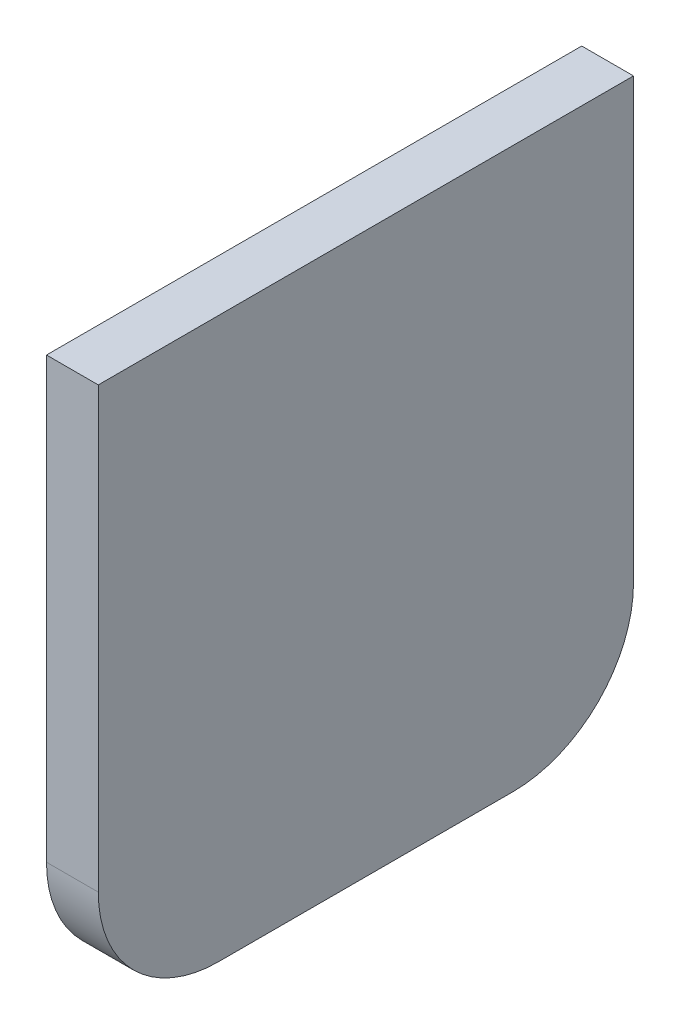
ISO-10303-21;
HEADER;
FILE_DESCRIPTION(('STEP AP214'),'2;1');
FILE_NAME('part.step','',(''),(''),'','','');
FILE_SCHEMA(('AUTOMOTIVE_DESIGN { 1 0 10303 214 1 1 1 1 }'));
ENDSEC;
DATA;
#1=APPLICATION_CONTEXT('core data for automotive mechanical design processes');
#2=APPLICATION_PROTOCOL_DEFINITION('international standard','automotive_design',2000,#1);
#3=PRODUCT_CONTEXT('',#1,'mechanical');
#4=PRODUCT('Part','Part','',(#3));
#5=PRODUCT_RELATED_PRODUCT_CATEGORY('part','',(#4));
#6=PRODUCT_DEFINITION_FORMATION('','',#4);
#7=PRODUCT_DEFINITION_CONTEXT('part definition',#1,'design');
#8=PRODUCT_DEFINITION('design','',#6,#7);
#9=PRODUCT_DEFINITION_SHAPE('','',#8);
#10=(LENGTH_UNIT() NAMED_UNIT(*) SI_UNIT(.MILLI.,.METRE.));
#11=(NAMED_UNIT(*) PLANE_ANGLE_UNIT() SI_UNIT($,.RADIAN.));
#12=(NAMED_UNIT(*) SI_UNIT($,.STERADIAN.) SOLID_ANGLE_UNIT());
#13=UNCERTAINTY_MEASURE_WITH_UNIT(LENGTH_MEASURE(1.E-05),#10,'distance_accuracy_value','');
#14=(GEOMETRIC_REPRESENTATION_CONTEXT(3) GLOBAL_UNCERTAINTY_ASSIGNED_CONTEXT((#13)) GLOBAL_UNIT_ASSIGNED_CONTEXT((#10,
#11,#12)) REPRESENTATION_CONTEXT('',''));
#15=CARTESIAN_POINT('',(0.,0.,0.));
#16=DIRECTION('',(0.,0.,1.));
#17=DIRECTION('',(1.,0.,0.));
#18=AXIS2_PLACEMENT_3D('',#15,#16,#17);
#19=CARTESIAN_POINT('',(4.3,23.241,-22.225));
#20=DIRECTION('',(0.,0.,1.));
#21=DIRECTION('',(0.,-1.,0.));
#22=AXIS2_PLACEMENT_3D('',#19,#20,#21);
#23=PLANE('',#22);
#24=DIRECTION('',(0.,1.,0.));
#25=VECTOR('',#24,1.);
#26=CARTESIAN_POINT('',(4.3,23.241,-22.225));
#27=LINE('',#26,#25);
#28=CARTESIAN_POINT('',(4.3,-13.241,-22.225));
#29=VERTEX_POINT('',#28);
#30=CARTESIAN_POINT('',(4.3,23.241,-22.225));
#31=VERTEX_POINT('',#30);
#32=EDGE_CURVE('E98',#29,#31,#27,.T.);
#33=ORIENTED_EDGE('',*,*,#32,.F.);
#34=DIRECTION('',(-1.,0.,0.));
#35=VECTOR('',#34,1.);
#36=CARTESIAN_POINT('',(4.3,-13.241,-22.225));
#37=LINE('',#36,#35);
#38=CARTESIAN_POINT('',(0.,-13.241,-22.225));
#39=VERTEX_POINT('',#38);
#40=EDGE_CURVE('E124',#29,#39,#37,.T.);
#41=ORIENTED_EDGE('',*,*,#40,.T.);
#42=DIRECTION('',(0.,1.,0.));
#43=VECTOR('',#42,1.);
#44=CARTESIAN_POINT('',(0.,23.241,-22.225));
#45=LINE('',#44,#43);
#46=CARTESIAN_POINT('',(0.,23.241,-22.225));
#47=VERTEX_POINT('',#46);
#48=EDGE_CURVE('E121',#39,#47,#45,.T.);
#49=ORIENTED_EDGE('',*,*,#48,.T.);
#50=DIRECTION('',(-1.,0.,0.));
#51=VECTOR('',#50,1.);
#52=CARTESIAN_POINT('',(4.3,23.241,-22.225));
#53=LINE('',#52,#51);
#54=EDGE_CURVE('E114',#31,#47,#53,.T.);
#55=ORIENTED_EDGE('',*,*,#54,.F.);
#56=EDGE_LOOP('',(#33,#41,#49,#55));
#57=FACE_BOUND('',#56,.T.);
#58=ADVANCED_FACE('F43',(#57),#23,.F.);
#59=CARTESIAN_POINT('',(4.3,23.241,22.225));
#60=DIRECTION('',(0.,-1.,0.));
#61=DIRECTION('',(0.,0.,-1.));
#62=AXIS2_PLACEMENT_3D('',#59,#60,#61);
#63=PLANE('',#62);
#64=DIRECTION('',(0.,0.,1.));
#65=VECTOR('',#64,1.);
#66=CARTESIAN_POINT('',(0.,23.241,22.225));
#67=LINE('',#66,#65);
#68=CARTESIAN_POINT('',(0.,23.241,22.225));
#69=VERTEX_POINT('',#68);
#70=EDGE_CURVE('E161',#47,#69,#67,.T.);
#71=ORIENTED_EDGE('',*,*,#70,.T.);
#72=DIRECTION('',(-1.,0.,0.));
#73=VECTOR('',#72,1.);
#74=CARTESIAN_POINT('',(4.3,23.241,22.225));
#75=LINE('',#74,#73);
#76=CARTESIAN_POINT('',(4.3,23.241,22.225));
#77=VERTEX_POINT('',#76);
#78=EDGE_CURVE('E116',#77,#69,#75,.T.);
#79=ORIENTED_EDGE('',*,*,#78,.F.);
#80=DIRECTION('',(0.,0.,1.));
#81=VECTOR('',#80,1.);
#82=CARTESIAN_POINT('',(4.3,23.241,22.225));
#83=LINE('',#82,#81);
#84=EDGE_CURVE('E101',#31,#77,#83,.T.);
#85=ORIENTED_EDGE('',*,*,#84,.F.);
#86=ORIENTED_EDGE('',*,*,#54,.T.);
#87=EDGE_LOOP('',(#71,#79,#85,#86));
#88=FACE_BOUND('',#87,.T.);
#89=ADVANCED_FACE('F113',(#88),#63,.F.);
#90=CARTESIAN_POINT('',(4.3,23.241,22.225));
#91=DIRECTION('',(0.,0.,-1.));
#92=DIRECTION('',(0.,1.,0.));
#93=AXIS2_PLACEMENT_3D('',#90,#91,#92);
#94=PLANE('',#93);
#95=DIRECTION('',(0.,-1.,0.));
#96=VECTOR('',#95,1.);
#97=CARTESIAN_POINT('',(0.,23.241,22.225));
#98=LINE('',#97,#96);
#99=CARTESIAN_POINT('',(0.,-13.241,22.225));
#100=VERTEX_POINT('',#99);
#101=EDGE_CURVE('E158',#69,#100,#98,.T.);
#102=ORIENTED_EDGE('',*,*,#101,.T.);
#103=DIRECTION('',(-1.,0.,0.));
#104=VECTOR('',#103,1.);
#105=CARTESIAN_POINT('',(4.3,-13.241,22.225));
#106=LINE('',#105,#104);
#107=CARTESIAN_POINT('',(4.3,-13.241,22.225));
#108=VERTEX_POINT('',#107);
#109=EDGE_CURVE('E11',#100,#108,#106,.F.);
#110=ORIENTED_EDGE('',*,*,#109,.T.);
#111=DIRECTION('',(0.,-1.,0.));
#112=VECTOR('',#111,1.);
#113=CARTESIAN_POINT('',(4.3,23.241,22.225));
#114=LINE('',#113,#112);
#115=EDGE_CURVE('E118',#77,#108,#114,.T.);
#116=ORIENTED_EDGE('',*,*,#115,.F.);
#117=ORIENTED_EDGE('',*,*,#78,.T.);
#118=EDGE_LOOP('',(#102,#110,#116,#117));
#119=FACE_BOUND('',#118,.T.);
#120=ADVANCED_FACE('F159',(#119),#94,.F.);
#121=CARTESIAN_POINT('',(4.3,-23.241,22.225));
#122=DIRECTION('',(0.,1.,0.));
#123=DIRECTION('',(0.,0.,1.));
#124=AXIS2_PLACEMENT_3D('',#121,#122,#123);
#125=PLANE('',#124);
#126=DIRECTION('',(0.,0.,-1.));
#127=VECTOR('',#126,1.);
#128=CARTESIAN_POINT('',(0.,-23.241,22.225));
#129=LINE('',#128,#127);
#130=CARTESIAN_POINT('',(0.,-23.241,12.225));
#131=VERTEX_POINT('',#130);
#132=CARTESIAN_POINT('',(0.,-23.241,-12.225));
#133=VERTEX_POINT('',#132);
#134=EDGE_CURVE('E109',#131,#133,#129,.T.);
#135=ORIENTED_EDGE('',*,*,#134,.T.);
#136=DIRECTION('',(-1.,0.,0.));
#137=VECTOR('',#136,1.);
#138=CARTESIAN_POINT('',(4.3,-23.241,-12.225));
#139=LINE('',#138,#137);
#140=CARTESIAN_POINT('',(4.3,-23.241,-12.225));
#141=VERTEX_POINT('',#140);
#142=EDGE_CURVE('E65',#133,#141,#139,.F.);
#143=ORIENTED_EDGE('',*,*,#142,.T.);
#144=DIRECTION('',(0.,0.,-1.));
#145=VECTOR('',#144,1.);
#146=CARTESIAN_POINT('',(4.3,-23.241,22.225));
#147=LINE('',#146,#145);
#148=CARTESIAN_POINT('',(4.3,-23.241,12.225));
#149=VERTEX_POINT('',#148);
#150=EDGE_CURVE('E130',#149,#141,#147,.T.);
#151=ORIENTED_EDGE('',*,*,#150,.F.);
#152=DIRECTION('',(-1.,0.,0.));
#153=VECTOR('',#152,1.);
#154=CARTESIAN_POINT('',(4.3,-23.241,12.225));
#155=LINE('',#154,#153);
#156=EDGE_CURVE('E139',#149,#131,#155,.T.);
#157=ORIENTED_EDGE('',*,*,#156,.T.);
#158=EDGE_LOOP('',(#135,#143,#151,#157));
#159=FACE_BOUND('',#158,.T.);
#160=ADVANCED_FACE('F151',(#159),#125,.F.);
#161=CARTESIAN_POINT('',(4.3,0.,0.));
#162=DIRECTION('',(1.,0.,0.));
#163=DIRECTION('',(0.,0.,-1.));
#164=AXIS2_PLACEMENT_3D('',#161,#162,#163);
#165=PLANE('',#164);
#166=ORIENTED_EDGE('',*,*,#150,.T.);
#167=CARTESIAN_POINT('',(4.3,-13.241,-12.225));
#168=DIRECTION('',(1.,0.,0.));
#169=DIRECTION('',(0.,0.,-1.));
#170=AXIS2_PLACEMENT_3D('',#167,#168,#169);
#171=CIRCLE('',#170,10.);
#172=EDGE_CURVE('E52',#141,#29,#171,.T.);
#173=ORIENTED_EDGE('',*,*,#172,.T.);
#174=ORIENTED_EDGE('',*,*,#32,.T.);
#175=ORIENTED_EDGE('',*,*,#84,.T.);
#176=ORIENTED_EDGE('',*,*,#115,.T.);
#177=CARTESIAN_POINT('',(4.3,-13.241,12.225));
#178=DIRECTION('',(1.,0.,0.));
#179=DIRECTION('',(0.,0.,-1.));
#180=AXIS2_PLACEMENT_3D('',#177,#178,#179);
#181=CIRCLE('',#180,10.);
#182=EDGE_CURVE('E145',#108,#149,#181,.T.);
#183=ORIENTED_EDGE('',*,*,#182,.T.);
#184=EDGE_LOOP('',(#166,#173,#174,#175,#176,#183));
#185=FACE_BOUND('',#184,.T.);
#186=ADVANCED_FACE('F100',(#185),#165,.T.);
#187=CARTESIAN_POINT('',(0.,0.,0.));
#188=DIRECTION('',(1.,0.,0.));
#189=DIRECTION('',(0.,0.,-1.));
#190=AXIS2_PLACEMENT_3D('',#187,#188,#189);
#191=PLANE('',#190);
#192=ORIENTED_EDGE('',*,*,#48,.F.);
#193=CARTESIAN_POINT('',(0.,-13.241,-12.225));
#194=DIRECTION('',(1.,0.,0.));
#195=DIRECTION('',(0.,0.,-1.));
#196=AXIS2_PLACEMENT_3D('',#193,#194,#195);
#197=CIRCLE('',#196,10.);
#198=EDGE_CURVE('E136',#39,#133,#197,.F.);
#199=ORIENTED_EDGE('',*,*,#198,.T.);
#200=ORIENTED_EDGE('',*,*,#134,.F.);
#201=CARTESIAN_POINT('',(0.,-13.241,12.225));
#202=DIRECTION('',(1.,0.,0.));
#203=DIRECTION('',(0.,0.,-1.));
#204=AXIS2_PLACEMENT_3D('',#201,#202,#203);
#205=CIRCLE('',#204,10.);
#206=EDGE_CURVE('E128',#131,#100,#205,.F.);
#207=ORIENTED_EDGE('',*,*,#206,.T.);
#208=ORIENTED_EDGE('',*,*,#101,.F.);
#209=ORIENTED_EDGE('',*,*,#70,.F.);
#210=EDGE_LOOP('',(#192,#199,#200,#207,#208,#209));
#211=FACE_BOUND('',#210,.T.);
#212=ADVANCED_FACE('F157',(#211),#191,.F.);
#213=CARTESIAN_POINT('',(4.3,-13.241,-12.225));
#214=DIRECTION('',(-1.,0.,0.));
#215=DIRECTION('',(0.,0.,1.));
#216=AXIS2_PLACEMENT_3D('',#213,#214,#215);
#217=CYLINDRICAL_SURFACE('',#216,10.);
#218=ORIENTED_EDGE('',*,*,#172,.F.);
#219=ORIENTED_EDGE('',*,*,#142,.F.);
#220=ORIENTED_EDGE('',*,*,#198,.F.);
#221=ORIENTED_EDGE('',*,*,#40,.F.);
#222=EDGE_LOOP('',(#218,#219,#220,#221));
#223=FACE_BOUND('',#222,.T.);
#224=ADVANCED_FACE('F171',(#223),#217,.T.);
#225=CARTESIAN_POINT('',(4.3,-13.241,12.225));
#226=DIRECTION('',(-1.,0.,0.));
#227=DIRECTION('',(0.,0.,1.));
#228=AXIS2_PLACEMENT_3D('',#225,#226,#227);
#229=CYLINDRICAL_SURFACE('',#228,10.);
#230=ORIENTED_EDGE('',*,*,#182,.F.);
#231=ORIENTED_EDGE('',*,*,#109,.F.);
#232=ORIENTED_EDGE('',*,*,#206,.F.);
#233=ORIENTED_EDGE('',*,*,#156,.F.);
#234=EDGE_LOOP('',(#230,#231,#232,#233));
#235=FACE_BOUND('',#234,.T.);
#236=ADVANCED_FACE('F45',(#235),#229,.T.);
#237=CLOSED_SHELL('',(#58,#89,#120,#160,#186,#212,#224,#236));
#238=MANIFOLD_SOLID_BREP('B2',#237);
#239=ADVANCED_BREP_SHAPE_REPRESENTATION('',(#18,#238),#14);
#240=SHAPE_DEFINITION_REPRESENTATION(#9,#239);
ENDSEC;
END-ISO-10303-21;
